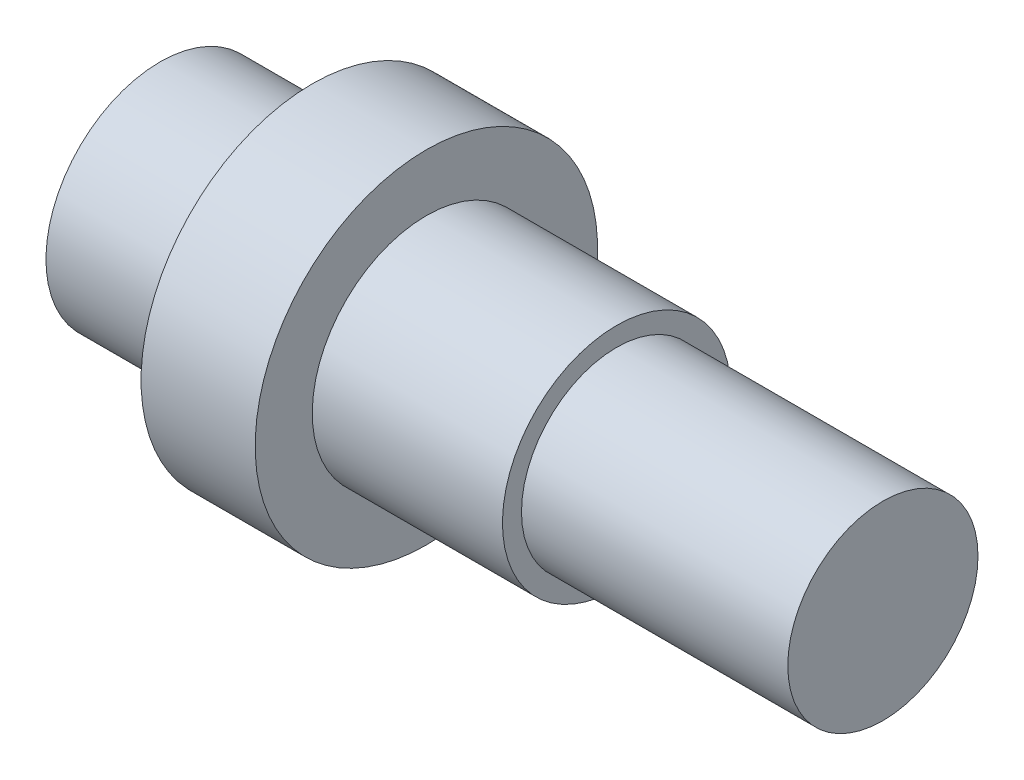
ISO-10303-21;
HEADER;
FILE_DESCRIPTION(('STEP AP214'),'2;1');
FILE_NAME('part.step','',(''),(''),'','','');
FILE_SCHEMA(('AUTOMOTIVE_DESIGN { 1 0 10303 214 1 1 1 1 }'));
ENDSEC;
DATA;
#1=APPLICATION_CONTEXT('core data for automotive mechanical design processes');
#2=APPLICATION_PROTOCOL_DEFINITION('international standard','automotive_design',2000,#1);
#3=PRODUCT_CONTEXT('',#1,'mechanical');
#4=PRODUCT('Part','Part','',(#3));
#5=PRODUCT_RELATED_PRODUCT_CATEGORY('part','',(#4));
#6=PRODUCT_DEFINITION_FORMATION('','',#4);
#7=PRODUCT_DEFINITION_CONTEXT('part definition',#1,'design');
#8=PRODUCT_DEFINITION('design','',#6,#7);
#9=PRODUCT_DEFINITION_SHAPE('','',#8);
#10=(LENGTH_UNIT() NAMED_UNIT(*) SI_UNIT(.MILLI.,.METRE.));
#11=(NAMED_UNIT(*) PLANE_ANGLE_UNIT() SI_UNIT($,.RADIAN.));
#12=(NAMED_UNIT(*) SI_UNIT($,.STERADIAN.) SOLID_ANGLE_UNIT());
#13=UNCERTAINTY_MEASURE_WITH_UNIT(LENGTH_MEASURE(1.E-05),#10,'distance_accuracy_value','');
#14=(GEOMETRIC_REPRESENTATION_CONTEXT(3) GLOBAL_UNCERTAINTY_ASSIGNED_CONTEXT((#13)) GLOBAL_UNIT_ASSIGNED_CONTEXT((#10,
#11,#12)) REPRESENTATION_CONTEXT('',''));
#15=CARTESIAN_POINT('',(0.,0.,0.));
#16=DIRECTION('',(0.,0.,1.));
#17=DIRECTION('',(1.,0.,0.));
#18=AXIS2_PLACEMENT_3D('',#15,#16,#17);
#19=CARTESIAN_POINT('',(0.,0.,0.));
#20=DIRECTION('',(-1.,0.,0.));
#21=DIRECTION('',(0.,-1.,0.));
#22=AXIS2_PLACEMENT_3D('',#19,#20,#21);
#23=PLANE('',#22);
#24=CARTESIAN_POINT('',(0.,0.,0.));
#25=DIRECTION('',(1.,0.,0.));
#26=DIRECTION('',(0.,1.,0.));
#27=AXIS2_PLACEMENT_3D('',#24,#25,#26);
#28=CIRCLE('',#27,15.);
#29=CARTESIAN_POINT('',(0.,15.,0.));
#30=VERTEX_POINT('',#29);
#31=EDGE_CURVE('E10',#30,#30,#28,.T.);
#32=ORIENTED_EDGE('',*,*,#31,.F.);
#33=EDGE_LOOP('',(#32));
#34=FACE_BOUND('',#33,.T.);
#35=ADVANCED_FACE('F33',(#34),#23,.T.);
#36=CARTESIAN_POINT('',(95.,0.,0.));
#37=DIRECTION('',(1.,0.,0.));
#38=DIRECTION('',(0.,1.,0.));
#39=AXIS2_PLACEMENT_3D('',#36,#37,#38);
#40=CYLINDRICAL_SURFACE('',#39,15.);
#41=ORIENTED_EDGE('',*,*,#31,.T.);
#42=EDGE_LOOP('',(#41));
#43=FACE_BOUND('',#42,.T.);
#44=CARTESIAN_POINT('',(20.,0.,0.));
#45=DIRECTION('',(1.,0.,0.));
#46=DIRECTION('',(0.,1.,0.));
#47=AXIS2_PLACEMENT_3D('',#44,#45,#46);
#48=CIRCLE('',#47,15.);
#49=CARTESIAN_POINT('',(20.,15.,0.));
#50=VERTEX_POINT('',#49);
#51=EDGE_CURVE('E39',#50,#50,#48,.T.);
#52=ORIENTED_EDGE('',*,*,#51,.F.);
#53=EDGE_LOOP('',(#52));
#54=FACE_BOUND('',#53,.T.);
#55=ADVANCED_FACE('F81',(#43,#54),#40,.T.);
#56=CARTESIAN_POINT('',(20.,15.,0.));
#57=DIRECTION('',(-1.,0.,0.));
#58=DIRECTION('',(0.,-1.,0.));
#59=AXIS2_PLACEMENT_3D('',#56,#57,#58);
#60=PLANE('',#59);
#61=ORIENTED_EDGE('',*,*,#51,.T.);
#62=EDGE_LOOP('',(#61));
#63=FACE_BOUND('',#62,.T.);
#64=CARTESIAN_POINT('',(20.,0.,0.));
#65=DIRECTION('',(1.,0.,0.));
#66=DIRECTION('',(0.,1.,0.));
#67=AXIS2_PLACEMENT_3D('',#64,#65,#66);
#68=CIRCLE('',#67,22.5);
#69=CARTESIAN_POINT('',(20.,22.5,0.));
#70=VERTEX_POINT('',#69);
#71=EDGE_CURVE('E43',#70,#70,#68,.T.);
#72=ORIENTED_EDGE('',*,*,#71,.F.);
#73=EDGE_LOOP('',(#72));
#74=FACE_BOUND('',#73,.T.);
#75=ADVANCED_FACE('F86',(#63,#74),#60,.T.);
#76=CARTESIAN_POINT('',(95.,0.,0.));
#77=DIRECTION('',(1.,0.,0.));
#78=DIRECTION('',(0.,1.,0.));
#79=AXIS2_PLACEMENT_3D('',#76,#77,#78);
#80=CYLINDRICAL_SURFACE('',#79,22.5);
#81=ORIENTED_EDGE('',*,*,#71,.T.);
#82=EDGE_LOOP('',(#81));
#83=FACE_BOUND('',#82,.T.);
#84=CARTESIAN_POINT('',(35.,0.,0.));
#85=DIRECTION('',(1.,0.,0.));
#86=DIRECTION('',(0.,1.,0.));
#87=AXIS2_PLACEMENT_3D('',#84,#85,#86);
#88=CIRCLE('',#87,22.5);
#89=CARTESIAN_POINT('',(35.,22.5,0.));
#90=VERTEX_POINT('',#89);
#91=EDGE_CURVE('E47',#90,#90,#88,.T.);
#92=ORIENTED_EDGE('',*,*,#91,.F.);
#93=EDGE_LOOP('',(#92));
#94=FACE_BOUND('',#93,.T.);
#95=ADVANCED_FACE('F90',(#83,#94),#80,.T.);
#96=CARTESIAN_POINT('',(35.,22.5,0.));
#97=DIRECTION('',(1.,0.,0.));
#98=DIRECTION('',(0.,1.,0.));
#99=AXIS2_PLACEMENT_3D('',#96,#97,#98);
#100=PLANE('',#99);
#101=ORIENTED_EDGE('',*,*,#91,.T.);
#102=EDGE_LOOP('',(#101));
#103=FACE_BOUND('',#102,.T.);
#104=CARTESIAN_POINT('',(35.,0.,0.));
#105=DIRECTION('',(1.,0.,0.));
#106=DIRECTION('',(0.,1.,0.));
#107=AXIS2_PLACEMENT_3D('',#104,#105,#106);
#108=CIRCLE('',#107,15.);
#109=CARTESIAN_POINT('',(35.,15.,0.));
#110=VERTEX_POINT('',#109);
#111=EDGE_CURVE('E52',#110,#110,#108,.T.);
#112=ORIENTED_EDGE('',*,*,#111,.F.);
#113=EDGE_LOOP('',(#112));
#114=FACE_BOUND('',#113,.T.);
#115=ADVANCED_FACE('F96',(#103,#114),#100,.T.);
#116=CARTESIAN_POINT('',(95.,0.,0.));
#117=DIRECTION('',(1.,0.,0.));
#118=DIRECTION('',(0.,1.,0.));
#119=AXIS2_PLACEMENT_3D('',#116,#117,#118);
#120=CYLINDRICAL_SURFACE('',#119,15.);
#121=ORIENTED_EDGE('',*,*,#111,.T.);
#122=EDGE_LOOP('',(#121));
#123=FACE_BOUND('',#122,.T.);
#124=CARTESIAN_POINT('',(60.,0.,0.));
#125=DIRECTION('',(1.,0.,0.));
#126=DIRECTION('',(0.,1.,0.));
#127=AXIS2_PLACEMENT_3D('',#124,#125,#126);
#128=CIRCLE('',#127,15.);
#129=CARTESIAN_POINT('',(60.,15.,0.));
#130=VERTEX_POINT('',#129);
#131=EDGE_CURVE('E55',#130,#130,#128,.T.);
#132=ORIENTED_EDGE('',*,*,#131,.F.);
#133=EDGE_LOOP('',(#132));
#134=FACE_BOUND('',#133,.T.);
#135=ADVANCED_FACE('F77',(#123,#134),#120,.T.);
#136=CARTESIAN_POINT('',(60.,15.,0.));
#137=DIRECTION('',(1.,0.,0.));
#138=DIRECTION('',(0.,1.,0.));
#139=AXIS2_PLACEMENT_3D('',#136,#137,#138);
#140=PLANE('',#139);
#141=ORIENTED_EDGE('',*,*,#131,.T.);
#142=EDGE_LOOP('',(#141));
#143=FACE_BOUND('',#142,.T.);
#144=CARTESIAN_POINT('',(60.,0.,0.));
#145=DIRECTION('',(1.,0.,0.));
#146=DIRECTION('',(0.,1.,0.));
#147=AXIS2_PLACEMENT_3D('',#144,#145,#146);
#148=CIRCLE('',#147,12.5);
#149=CARTESIAN_POINT('',(60.,12.5,0.));
#150=VERTEX_POINT('',#149);
#151=EDGE_CURVE('E58',#150,#150,#148,.T.);
#152=ORIENTED_EDGE('',*,*,#151,.F.);
#153=EDGE_LOOP('',(#152));
#154=FACE_BOUND('',#153,.T.);
#155=ADVANCED_FACE('F69',(#143,#154),#140,.T.);
#156=CARTESIAN_POINT('',(95.,0.,0.));
#157=DIRECTION('',(1.,0.,0.));
#158=DIRECTION('',(0.,1.,0.));
#159=AXIS2_PLACEMENT_3D('',#156,#157,#158);
#160=CYLINDRICAL_SURFACE('',#159,12.5);
#161=ORIENTED_EDGE('',*,*,#151,.T.);
#162=EDGE_LOOP('',(#161));
#163=FACE_BOUND('',#162,.T.);
#164=CARTESIAN_POINT('',(95.,0.,0.));
#165=DIRECTION('',(1.,0.,0.));
#166=DIRECTION('',(0.,1.,0.));
#167=AXIS2_PLACEMENT_3D('',#164,#165,#166);
#168=CIRCLE('',#167,12.5);
#169=CARTESIAN_POINT('',(95.,12.5,0.));
#170=VERTEX_POINT('',#169);
#171=EDGE_CURVE('E61',#170,#170,#168,.T.);
#172=ORIENTED_EDGE('',*,*,#171,.F.);
#173=EDGE_LOOP('',(#172));
#174=FACE_BOUND('',#173,.T.);
#175=ADVANCED_FACE('F67',(#163,#174),#160,.T.);
#176=CARTESIAN_POINT('',(95.,12.5,0.));
#177=DIRECTION('',(1.,0.,0.));
#178=DIRECTION('',(0.,1.,0.));
#179=AXIS2_PLACEMENT_3D('',#176,#177,#178);
#180=PLANE('',#179);
#181=ORIENTED_EDGE('',*,*,#171,.T.);
#182=EDGE_LOOP('',(#181));
#183=FACE_BOUND('',#182,.T.);
#184=ADVANCED_FACE('F65',(#183),#180,.T.);
#185=CLOSED_SHELL('',(#35,#55,#75,#95,#115,#135,#155,#175,#184));
#186=MANIFOLD_SOLID_BREP('B2',#185);
#187=ADVANCED_BREP_SHAPE_REPRESENTATION('',(#18,#186),#14);
#188=SHAPE_DEFINITION_REPRESENTATION(#9,#187);
ENDSEC;
END-ISO-10303-21;
